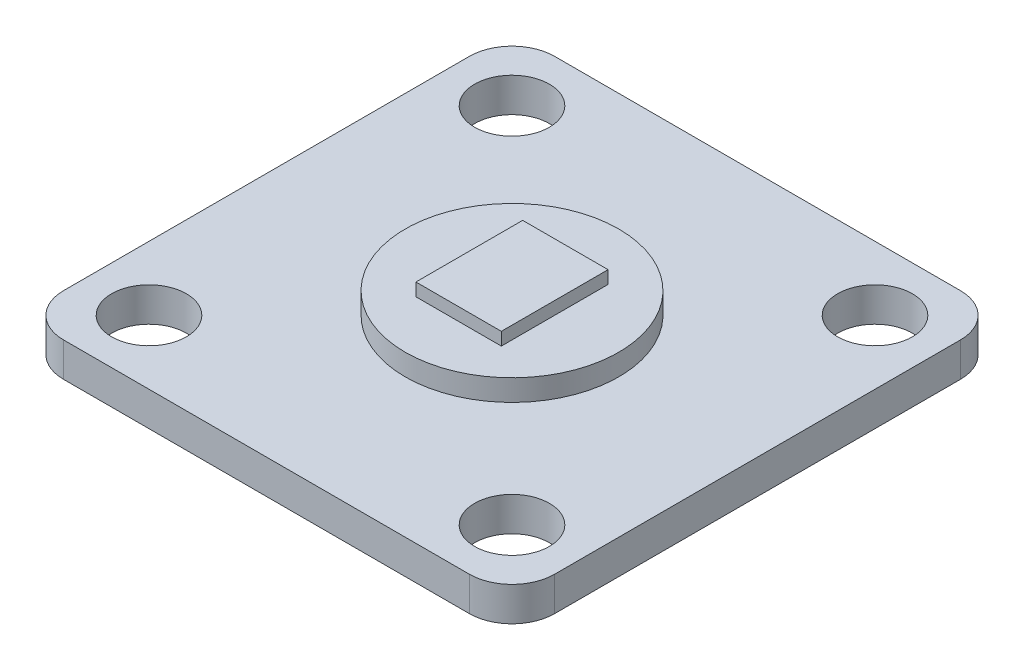
ISO-10303-21;
HEADER;
FILE_DESCRIPTION(('STEP AP214'),'2;1');
FILE_NAME('part.step','',(''),(''),'','','');
FILE_SCHEMA(('AUTOMOTIVE_DESIGN { 1 0 10303 214 1 1 1 1 }'));
ENDSEC;
DATA;
#1=APPLICATION_CONTEXT('core data for automotive mechanical design processes');
#2=APPLICATION_PROTOCOL_DEFINITION('international standard','automotive_design',2000,#1);
#3=PRODUCT_CONTEXT('',#1,'mechanical');
#4=PRODUCT('Part','Part','',(#3));
#5=PRODUCT_RELATED_PRODUCT_CATEGORY('part','',(#4));
#6=PRODUCT_DEFINITION_FORMATION('','',#4);
#7=PRODUCT_DEFINITION_CONTEXT('part definition',#1,'design');
#8=PRODUCT_DEFINITION('design','',#6,#7);
#9=PRODUCT_DEFINITION_SHAPE('','',#8);
#10=(LENGTH_UNIT() NAMED_UNIT(*) SI_UNIT(.MILLI.,.METRE.));
#11=(NAMED_UNIT(*) PLANE_ANGLE_UNIT() SI_UNIT($,.RADIAN.));
#12=(NAMED_UNIT(*) SI_UNIT($,.STERADIAN.) SOLID_ANGLE_UNIT());
#13=UNCERTAINTY_MEASURE_WITH_UNIT(LENGTH_MEASURE(1.E-05),#10,'distance_accuracy_value','');
#14=(GEOMETRIC_REPRESENTATION_CONTEXT(3) GLOBAL_UNCERTAINTY_ASSIGNED_CONTEXT((#13)) GLOBAL_UNIT_ASSIGNED_CONTEXT((#10,
#11,#12)) REPRESENTATION_CONTEXT('',''));
#15=CARTESIAN_POINT('',(0.,0.,0.));
#16=DIRECTION('',(0.,0.,1.));
#17=DIRECTION('',(1.,0.,0.));
#18=AXIS2_PLACEMENT_3D('',#15,#16,#17);
#19=CARTESIAN_POINT('',(-9.5,1.6,9.5));
#20=DIRECTION('',(0.,-1.,0.));
#21=DIRECTION('',(0.,0.,-1.));
#22=AXIS2_PLACEMENT_3D('',#19,#20,#21);
#23=PLANE('',#22);
#24=CARTESIAN_POINT('',(0.,1.6,0.));
#25=DIRECTION('',(0.,-1.,0.));
#26=DIRECTION('',(0.,0.,-1.));
#27=AXIS2_PLACEMENT_3D('',#24,#25,#26);
#28=CIRCLE('',#27,5.);
#29=CARTESIAN_POINT('',(0.,1.6,-5.));
#30=VERTEX_POINT('',#29);
#31=EDGE_CURVE('E11',#30,#30,#28,.F.);
#32=ORIENTED_EDGE('',*,*,#31,.F.);
#33=EDGE_LOOP('',(#32));
#34=FACE_BOUND('',#33,.T.);
#35=CARTESIAN_POINT('',(-8.5,1.6,-8.5));
#36=DIRECTION('',(0.,1.,0.));
#37=DIRECTION('',(0.,0.,1.));
#38=AXIS2_PLACEMENT_3D('',#35,#36,#37);
#39=CIRCLE('',#38,1.75);
#40=CARTESIAN_POINT('',(-8.5,1.6,-6.75));
#41=VERTEX_POINT('',#40);
#42=EDGE_CURVE('E239',#41,#41,#39,.T.);
#43=ORIENTED_EDGE('',*,*,#42,.F.);
#44=EDGE_LOOP('',(#43));
#45=FACE_BOUND('',#44,.T.);
#46=CARTESIAN_POINT('',(-8.5,1.6,8.5));
#47=DIRECTION('',(0.,1.,0.));
#48=DIRECTION('',(0.,0.,1.));
#49=AXIS2_PLACEMENT_3D('',#46,#47,#48);
#50=CIRCLE('',#49,1.75);
#51=CARTESIAN_POINT('',(-8.5,1.6,10.25));
#52=VERTEX_POINT('',#51);
#53=EDGE_CURVE('E247',#52,#52,#50,.T.);
#54=ORIENTED_EDGE('',*,*,#53,.F.);
#55=EDGE_LOOP('',(#54));
#56=FACE_BOUND('',#55,.T.);
#57=CARTESIAN_POINT('',(8.49999999999999,1.6,8.5));
#58=DIRECTION('',(0.,1.,0.));
#59=DIRECTION('',(0.,0.,1.));
#60=AXIS2_PLACEMENT_3D('',#57,#58,#59);
#61=CIRCLE('',#60,1.75);
#62=CARTESIAN_POINT('',(8.49999999999999,1.6,10.25));
#63=VERTEX_POINT('',#62);
#64=EDGE_CURVE('E255',#63,#63,#61,.T.);
#65=ORIENTED_EDGE('',*,*,#64,.F.);
#66=EDGE_LOOP('',(#65));
#67=FACE_BOUND('',#66,.T.);
#68=CARTESIAN_POINT('',(8.5,1.6,-8.5));
#69=DIRECTION('',(0.,1.,0.));
#70=DIRECTION('',(0.,0.,1.));
#71=AXIS2_PLACEMENT_3D('',#68,#69,#70);
#72=CIRCLE('',#71,1.75);
#73=CARTESIAN_POINT('',(8.5,1.6,-6.75));
#74=VERTEX_POINT('',#73);
#75=EDGE_CURVE('E159',#74,#74,#72,.T.);
#76=ORIENTED_EDGE('',*,*,#75,.F.);
#77=EDGE_LOOP('',(#76));
#78=FACE_BOUND('',#77,.T.);
#79=CARTESIAN_POINT('',(-9.5,1.6,9.5));
#80=DIRECTION('',(0.,1.,0.));
#81=DIRECTION('',(0.,0.,-1.));
#82=AXIS2_PLACEMENT_3D('',#79,#80,#81);
#83=CIRCLE('',#82,2.);
#84=CARTESIAN_POINT('',(-11.5,1.6,9.49999999999998));
#85=VERTEX_POINT('',#84);
#86=CARTESIAN_POINT('',(-9.49999999999999,1.6,11.5));
#87=VERTEX_POINT('',#86);
#88=EDGE_CURVE('E178',#85,#87,#83,.T.);
#89=ORIENTED_EDGE('',*,*,#88,.T.);
#90=DIRECTION('',(1.,0.,0.));
#91=VECTOR('',#90,1.);
#92=CARTESIAN_POINT('',(-9.49999999999999,1.6,11.5));
#93=LINE('',#92,#91);
#94=CARTESIAN_POINT('',(9.49999999999998,1.6,11.5));
#95=VERTEX_POINT('',#94);
#96=EDGE_CURVE('E108',#87,#95,#93,.T.);
#97=ORIENTED_EDGE('',*,*,#96,.T.);
#98=CARTESIAN_POINT('',(9.5,1.6,9.5));
#99=DIRECTION('',(0.,1.,0.));
#100=DIRECTION('',(0.,0.,1.));
#101=AXIS2_PLACEMENT_3D('',#98,#99,#100);
#102=CIRCLE('',#101,2.);
#103=CARTESIAN_POINT('',(11.5,1.6,9.49999999999998));
#104=VERTEX_POINT('',#103);
#105=EDGE_CURVE('E273',#95,#104,#102,.T.);
#106=ORIENTED_EDGE('',*,*,#105,.T.);
#107=DIRECTION('',(0.,0.,-1.));
#108=VECTOR('',#107,1.);
#109=CARTESIAN_POINT('',(11.5,1.6,9.49999999999998));
#110=LINE('',#109,#108);
#111=CARTESIAN_POINT('',(11.5,1.6,-9.49999999999999));
#112=VERTEX_POINT('',#111);
#113=EDGE_CURVE('E276',#104,#112,#110,.T.);
#114=ORIENTED_EDGE('',*,*,#113,.T.);
#115=CARTESIAN_POINT('',(9.5,1.6,-9.5));
#116=DIRECTION('',(0.,1.,0.));
#117=DIRECTION('',(0.,0.,-1.));
#118=AXIS2_PLACEMENT_3D('',#115,#116,#117);
#119=CIRCLE('',#118,2.);
#120=CARTESIAN_POINT('',(9.49999999999998,1.6,-11.5));
#121=VERTEX_POINT('',#120);
#122=EDGE_CURVE('E129',#112,#121,#119,.T.);
#123=ORIENTED_EDGE('',*,*,#122,.T.);
#124=DIRECTION('',(-1.,0.,0.));
#125=VECTOR('',#124,1.);
#126=CARTESIAN_POINT('',(-9.49999999999999,1.6,-11.5));
#127=LINE('',#126,#125);
#128=CARTESIAN_POINT('',(-9.49999999999999,1.6,-11.5));
#129=VERTEX_POINT('',#128);
#130=EDGE_CURVE('E123',#121,#129,#127,.T.);
#131=ORIENTED_EDGE('',*,*,#130,.T.);
#132=CARTESIAN_POINT('',(-9.5,1.6,-9.5));
#133=DIRECTION('',(0.,1.,0.));
#134=DIRECTION('',(0.,0.,-1.));
#135=AXIS2_PLACEMENT_3D('',#132,#133,#134);
#136=CIRCLE('',#135,2.);
#137=CARTESIAN_POINT('',(-11.5,1.6,-9.49999999999999));
#138=VERTEX_POINT('',#137);
#139=EDGE_CURVE('E126',#129,#138,#136,.T.);
#140=ORIENTED_EDGE('',*,*,#139,.T.);
#141=DIRECTION('',(0.,0.,1.));
#142=VECTOR('',#141,1.);
#143=CARTESIAN_POINT('',(-11.5,1.6,9.49999999999998));
#144=LINE('',#143,#142);
#145=EDGE_CURVE('E66',#138,#85,#144,.T.);
#146=ORIENTED_EDGE('',*,*,#145,.T.);
#147=EDGE_LOOP('',(#89,#97,#106,#114,#123,#131,#140,#146));
#148=FACE_BOUND('',#147,.T.);
#149=ADVANCED_FACE('F41',(#34,#45,#56,#67,#78,#148),#23,.F.);
#150=CARTESIAN_POINT('',(-9.5,0.,9.5));
#151=DIRECTION('',(0.,-1.,0.));
#152=DIRECTION('',(0.,0.,-1.));
#153=AXIS2_PLACEMENT_3D('',#150,#151,#152);
#154=PLANE('',#153);
#155=CARTESIAN_POINT('',(-8.5,0.,8.5));
#156=DIRECTION('',(0.,1.,0.));
#157=DIRECTION('',(0.,0.,1.));
#158=AXIS2_PLACEMENT_3D('',#155,#156,#157);
#159=CIRCLE('',#158,1.75);
#160=CARTESIAN_POINT('',(-8.5,0.,10.25));
#161=VERTEX_POINT('',#160);
#162=EDGE_CURVE('E243',#161,#161,#159,.T.);
#163=ORIENTED_EDGE('',*,*,#162,.T.);
#164=EDGE_LOOP('',(#163));
#165=FACE_BOUND('',#164,.T.);
#166=CARTESIAN_POINT('',(8.5,0.,-8.5));
#167=DIRECTION('',(0.,1.,0.));
#168=DIRECTION('',(0.,0.,1.));
#169=AXIS2_PLACEMENT_3D('',#166,#167,#168);
#170=CIRCLE('',#169,1.75);
#171=CARTESIAN_POINT('',(8.5,0.,-6.75));
#172=VERTEX_POINT('',#171);
#173=EDGE_CURVE('E259',#172,#172,#170,.T.);
#174=ORIENTED_EDGE('',*,*,#173,.T.);
#175=EDGE_LOOP('',(#174));
#176=FACE_BOUND('',#175,.T.);
#177=CARTESIAN_POINT('',(-9.5,0.,9.5));
#178=DIRECTION('',(0.,1.,0.));
#179=DIRECTION('',(0.,0.,-1.));
#180=AXIS2_PLACEMENT_3D('',#177,#178,#179);
#181=CIRCLE('',#180,2.);
#182=CARTESIAN_POINT('',(-11.5,0.,9.49999999999998));
#183=VERTEX_POINT('',#182);
#184=CARTESIAN_POINT('',(-9.49999999999999,0.,11.5));
#185=VERTEX_POINT('',#184);
#186=EDGE_CURVE('E154',#183,#185,#181,.T.);
#187=ORIENTED_EDGE('',*,*,#186,.F.);
#188=DIRECTION('',(0.,0.,1.));
#189=VECTOR('',#188,1.);
#190=CARTESIAN_POINT('',(-11.5,0.,9.49999999999998));
#191=LINE('',#190,#189);
#192=CARTESIAN_POINT('',(-11.5,0.,-9.49999999999999));
#193=VERTEX_POINT('',#192);
#194=EDGE_CURVE('E99',#193,#183,#191,.T.);
#195=ORIENTED_EDGE('',*,*,#194,.F.);
#196=CARTESIAN_POINT('',(-9.5,0.,-9.5));
#197=DIRECTION('',(0.,1.,0.));
#198=DIRECTION('',(0.,0.,-1.));
#199=AXIS2_PLACEMENT_3D('',#196,#197,#198);
#200=CIRCLE('',#199,2.);
#201=CARTESIAN_POINT('',(-9.49999999999999,0.,-11.5));
#202=VERTEX_POINT('',#201);
#203=EDGE_CURVE('E173',#202,#193,#200,.T.);
#204=ORIENTED_EDGE('',*,*,#203,.F.);
#205=DIRECTION('',(-1.,0.,0.));
#206=VECTOR('',#205,1.);
#207=CARTESIAN_POINT('',(-9.49999999999999,0.,-11.5));
#208=LINE('',#207,#206);
#209=CARTESIAN_POINT('',(9.49999999999998,0.,-11.5));
#210=VERTEX_POINT('',#209);
#211=EDGE_CURVE('E139',#210,#202,#208,.T.);
#212=ORIENTED_EDGE('',*,*,#211,.F.);
#213=CARTESIAN_POINT('',(9.5,0.,-9.5));
#214=DIRECTION('',(0.,1.,0.));
#215=DIRECTION('',(0.,0.,-1.));
#216=AXIS2_PLACEMENT_3D('',#213,#214,#215);
#217=CIRCLE('',#216,2.);
#218=CARTESIAN_POINT('',(11.5,0.,-9.49999999999999));
#219=VERTEX_POINT('',#218);
#220=EDGE_CURVE('E168',#219,#210,#217,.T.);
#221=ORIENTED_EDGE('',*,*,#220,.F.);
#222=DIRECTION('',(0.,0.,-1.));
#223=VECTOR('',#222,1.);
#224=CARTESIAN_POINT('',(11.5,0.,9.49999999999998));
#225=LINE('',#224,#223);
#226=CARTESIAN_POINT('',(11.5,0.,9.49999999999998));
#227=VERTEX_POINT('',#226);
#228=EDGE_CURVE('E165',#227,#219,#225,.T.);
#229=ORIENTED_EDGE('',*,*,#228,.F.);
#230=CARTESIAN_POINT('',(9.5,0.,9.5));
#231=DIRECTION('',(0.,1.,0.));
#232=DIRECTION('',(0.,0.,1.));
#233=AXIS2_PLACEMENT_3D('',#230,#231,#232);
#234=CIRCLE('',#233,2.);
#235=CARTESIAN_POINT('',(9.49999999999998,0.,11.5));
#236=VERTEX_POINT('',#235);
#237=EDGE_CURVE('E162',#236,#227,#234,.T.);
#238=ORIENTED_EDGE('',*,*,#237,.F.);
#239=DIRECTION('',(1.,0.,0.));
#240=VECTOR('',#239,1.);
#241=CARTESIAN_POINT('',(-9.49999999999999,0.,11.5));
#242=LINE('',#241,#240);
#243=EDGE_CURVE('E158',#185,#236,#242,.T.);
#244=ORIENTED_EDGE('',*,*,#243,.F.);
#245=EDGE_LOOP('',(#187,#195,#204,#212,#221,#229,#238,#244));
#246=FACE_BOUND('',#245,.T.);
#247=CARTESIAN_POINT('',(8.49999999999999,0.,8.5));
#248=DIRECTION('',(0.,1.,0.));
#249=DIRECTION('',(0.,0.,1.));
#250=AXIS2_PLACEMENT_3D('',#247,#248,#249);
#251=CIRCLE('',#250,1.75);
#252=CARTESIAN_POINT('',(8.49999999999999,0.,10.25));
#253=VERTEX_POINT('',#252);
#254=EDGE_CURVE('E251',#253,#253,#251,.T.);
#255=ORIENTED_EDGE('',*,*,#254,.T.);
#256=EDGE_LOOP('',(#255));
#257=FACE_BOUND('',#256,.T.);
#258=CARTESIAN_POINT('',(-8.5,0.,-8.5));
#259=DIRECTION('',(0.,1.,0.));
#260=DIRECTION('',(0.,0.,1.));
#261=AXIS2_PLACEMENT_3D('',#258,#259,#260);
#262=CIRCLE('',#261,1.75);
#263=CARTESIAN_POINT('',(-8.5,0.,-6.75));
#264=VERTEX_POINT('',#263);
#265=EDGE_CURVE('E238',#264,#264,#262,.T.);
#266=ORIENTED_EDGE('',*,*,#265,.T.);
#267=EDGE_LOOP('',(#266));
#268=FACE_BOUND('',#267,.T.);
#269=ADVANCED_FACE('F291',(#165,#176,#246,#257,#268),#154,.T.);
#270=CARTESIAN_POINT('',(-9.5,1.6,9.5));
#271=DIRECTION('',(0.,-1.,0.));
#272=DIRECTION('',(0.,0.,-1.));
#273=AXIS2_PLACEMENT_3D('',#270,#271,#272);
#274=CYLINDRICAL_SURFACE('',#273,2.);
#275=ORIENTED_EDGE('',*,*,#186,.T.);
#276=DIRECTION('',(0.,-1.,0.));
#277=VECTOR('',#276,1.);
#278=CARTESIAN_POINT('',(-9.49999999999999,1.6,11.5));
#279=LINE('',#278,#277);
#280=EDGE_CURVE('E197',#87,#185,#279,.T.);
#281=ORIENTED_EDGE('',*,*,#280,.F.);
#282=ORIENTED_EDGE('',*,*,#88,.F.);
#283=DIRECTION('',(0.,-1.,0.));
#284=VECTOR('',#283,1.);
#285=CARTESIAN_POINT('',(-11.5,1.6,9.49999999999998));
#286=LINE('',#285,#284);
#287=EDGE_CURVE('E150',#85,#183,#286,.T.);
#288=ORIENTED_EDGE('',*,*,#287,.T.);
#289=EDGE_LOOP('',(#275,#281,#282,#288));
#290=FACE_BOUND('',#289,.T.);
#291=ADVANCED_FACE('F43',(#290),#274,.T.);
#292=CARTESIAN_POINT('',(-9.49999999999999,1.6,11.5));
#293=DIRECTION('',(0.,0.,-1.));
#294=DIRECTION('',(-1.,0.,0.));
#295=AXIS2_PLACEMENT_3D('',#292,#293,#294);
#296=PLANE('',#295);
#297=ORIENTED_EDGE('',*,*,#243,.T.);
#298=DIRECTION('',(0.,-1.,0.));
#299=VECTOR('',#298,1.);
#300=CARTESIAN_POINT('',(9.49999999999998,1.6,11.5));
#301=LINE('',#300,#299);
#302=EDGE_CURVE('E193',#95,#236,#301,.T.);
#303=ORIENTED_EDGE('',*,*,#302,.F.);
#304=ORIENTED_EDGE('',*,*,#96,.F.);
#305=ORIENTED_EDGE('',*,*,#280,.T.);
#306=EDGE_LOOP('',(#297,#303,#304,#305));
#307=FACE_BOUND('',#306,.T.);
#308=ADVANCED_FACE('F297',(#307),#296,.F.);
#309=CARTESIAN_POINT('',(9.5,1.6,9.5));
#310=DIRECTION('',(0.,-1.,0.));
#311=DIRECTION('',(0.,0.,-1.));
#312=AXIS2_PLACEMENT_3D('',#309,#310,#311);
#313=CYLINDRICAL_SURFACE('',#312,2.);
#314=ORIENTED_EDGE('',*,*,#237,.T.);
#315=DIRECTION('',(0.,-1.,0.));
#316=VECTOR('',#315,1.);
#317=CARTESIAN_POINT('',(11.5,1.6,9.49999999999998));
#318=LINE('',#317,#316);
#319=EDGE_CURVE('E189',#104,#227,#318,.T.);
#320=ORIENTED_EDGE('',*,*,#319,.F.);
#321=ORIENTED_EDGE('',*,*,#105,.F.);
#322=ORIENTED_EDGE('',*,*,#302,.T.);
#323=EDGE_LOOP('',(#314,#320,#321,#322));
#324=FACE_BOUND('',#323,.T.);
#325=ADVANCED_FACE('F300',(#324),#313,.T.);
#326=CARTESIAN_POINT('',(11.5,1.6,9.49999999999998));
#327=DIRECTION('',(-1.,0.,0.));
#328=DIRECTION('',(0.,0.,1.));
#329=AXIS2_PLACEMENT_3D('',#326,#327,#328);
#330=PLANE('',#329);
#331=ORIENTED_EDGE('',*,*,#228,.T.);
#332=DIRECTION('',(0.,-1.,0.));
#333=VECTOR('',#332,1.);
#334=CARTESIAN_POINT('',(11.5,1.6,-9.49999999999999));
#335=LINE('',#334,#333);
#336=EDGE_CURVE('E185',#112,#219,#335,.T.);
#337=ORIENTED_EDGE('',*,*,#336,.F.);
#338=ORIENTED_EDGE('',*,*,#113,.F.);
#339=ORIENTED_EDGE('',*,*,#319,.T.);
#340=EDGE_LOOP('',(#331,#337,#338,#339));
#341=FACE_BOUND('',#340,.T.);
#342=ADVANCED_FACE('F284',(#341),#330,.F.);
#343=CARTESIAN_POINT('',(9.5,1.6,-9.5));
#344=DIRECTION('',(0.,-1.,0.));
#345=DIRECTION('',(0.,0.,-1.));
#346=AXIS2_PLACEMENT_3D('',#343,#344,#345);
#347=CYLINDRICAL_SURFACE('',#346,2.);
#348=ORIENTED_EDGE('',*,*,#220,.T.);
#349=DIRECTION('',(0.,-1.,0.));
#350=VECTOR('',#349,1.);
#351=CARTESIAN_POINT('',(9.49999999999998,1.6,-11.5));
#352=LINE('',#351,#350);
#353=EDGE_CURVE('E143',#121,#210,#352,.T.);
#354=ORIENTED_EDGE('',*,*,#353,.F.);
#355=ORIENTED_EDGE('',*,*,#122,.F.);
#356=ORIENTED_EDGE('',*,*,#336,.T.);
#357=EDGE_LOOP('',(#348,#354,#355,#356));
#358=FACE_BOUND('',#357,.T.);
#359=ADVANCED_FACE('F288',(#358),#347,.T.);
#360=CARTESIAN_POINT('',(-9.49999999999999,1.6,-11.5));
#361=DIRECTION('',(0.,0.,1.));
#362=DIRECTION('',(1.,0.,0.));
#363=AXIS2_PLACEMENT_3D('',#360,#361,#362);
#364=PLANE('',#363);
#365=ORIENTED_EDGE('',*,*,#211,.T.);
#366=DIRECTION('',(0.,-1.,0.));
#367=VECTOR('',#366,1.);
#368=CARTESIAN_POINT('',(-9.49999999999999,1.6,-11.5));
#369=LINE('',#368,#367);
#370=EDGE_CURVE('E136',#129,#202,#369,.T.);
#371=ORIENTED_EDGE('',*,*,#370,.F.);
#372=ORIENTED_EDGE('',*,*,#130,.F.);
#373=ORIENTED_EDGE('',*,*,#353,.T.);
#374=EDGE_LOOP('',(#365,#371,#372,#373));
#375=FACE_BOUND('',#374,.T.);
#376=ADVANCED_FACE('F137',(#375),#364,.F.);
#377=CARTESIAN_POINT('',(-9.5,1.6,-9.5));
#378=DIRECTION('',(0.,-1.,0.));
#379=DIRECTION('',(0.,0.,-1.));
#380=AXIS2_PLACEMENT_3D('',#377,#378,#379);
#381=CYLINDRICAL_SURFACE('',#380,2.);
#382=ORIENTED_EDGE('',*,*,#203,.T.);
#383=DIRECTION('',(0.,-1.,0.));
#384=VECTOR('',#383,1.);
#385=CARTESIAN_POINT('',(-11.5,1.6,-9.49999999999999));
#386=LINE('',#385,#384);
#387=EDGE_CURVE('E144',#138,#193,#386,.T.);
#388=ORIENTED_EDGE('',*,*,#387,.F.);
#389=ORIENTED_EDGE('',*,*,#139,.F.);
#390=ORIENTED_EDGE('',*,*,#370,.T.);
#391=EDGE_LOOP('',(#382,#388,#389,#390));
#392=FACE_BOUND('',#391,.T.);
#393=ADVANCED_FACE('F146',(#392),#381,.T.);
#394=CARTESIAN_POINT('',(-11.5,1.6,9.49999999999998));
#395=DIRECTION('',(1.,0.,0.));
#396=DIRECTION('',(0.,0.,-1.));
#397=AXIS2_PLACEMENT_3D('',#394,#395,#396);
#398=PLANE('',#397);
#399=ORIENTED_EDGE('',*,*,#194,.T.);
#400=ORIENTED_EDGE('',*,*,#287,.F.);
#401=ORIENTED_EDGE('',*,*,#145,.F.);
#402=ORIENTED_EDGE('',*,*,#387,.T.);
#403=EDGE_LOOP('',(#399,#400,#401,#402));
#404=FACE_BOUND('',#403,.T.);
#405=ADVANCED_FACE('F293',(#404),#398,.F.);
#406=CARTESIAN_POINT('',(8.5,1.6,-8.5));
#407=DIRECTION('',(0.,-1.,0.));
#408=DIRECTION('',(0.,0.,-1.));
#409=AXIS2_PLACEMENT_3D('',#406,#407,#408);
#410=CYLINDRICAL_SURFACE('',#409,1.75);
#411=ORIENTED_EDGE('',*,*,#75,.T.);
#412=EDGE_LOOP('',(#411));
#413=FACE_BOUND('',#412,.T.);
#414=ORIENTED_EDGE('',*,*,#173,.F.);
#415=EDGE_LOOP('',(#414));
#416=FACE_BOUND('',#415,.T.);
#417=ADVANCED_FACE('F321',(#413,#416),#410,.F.);
#418=CARTESIAN_POINT('',(8.49999999999999,1.6,8.5));
#419=DIRECTION('',(0.,-1.,0.));
#420=DIRECTION('',(0.,0.,-1.));
#421=AXIS2_PLACEMENT_3D('',#418,#419,#420);
#422=CYLINDRICAL_SURFACE('',#421,1.75);
#423=ORIENTED_EDGE('',*,*,#64,.T.);
#424=EDGE_LOOP('',(#423));
#425=FACE_BOUND('',#424,.T.);
#426=ORIENTED_EDGE('',*,*,#254,.F.);
#427=EDGE_LOOP('',(#426));
#428=FACE_BOUND('',#427,.T.);
#429=ADVANCED_FACE('F353',(#425,#428),#422,.F.);
#430=CARTESIAN_POINT('',(-8.5,1.6,8.5));
#431=DIRECTION('',(0.,-1.,0.));
#432=DIRECTION('',(0.,0.,-1.));
#433=AXIS2_PLACEMENT_3D('',#430,#431,#432);
#434=CYLINDRICAL_SURFACE('',#433,1.75);
#435=ORIENTED_EDGE('',*,*,#53,.T.);
#436=EDGE_LOOP('',(#435));
#437=FACE_BOUND('',#436,.T.);
#438=ORIENTED_EDGE('',*,*,#162,.F.);
#439=EDGE_LOOP('',(#438));
#440=FACE_BOUND('',#439,.T.);
#441=ADVANCED_FACE('F360',(#437,#440),#434,.F.);
#442=CARTESIAN_POINT('',(-8.5,1.6,-8.5));
#443=DIRECTION('',(0.,-1.,0.));
#444=DIRECTION('',(0.,0.,-1.));
#445=AXIS2_PLACEMENT_3D('',#442,#443,#444);
#446=CYLINDRICAL_SURFACE('',#445,1.75);
#447=ORIENTED_EDGE('',*,*,#42,.T.);
#448=EDGE_LOOP('',(#447));
#449=FACE_BOUND('',#448,.T.);
#450=ORIENTED_EDGE('',*,*,#265,.F.);
#451=EDGE_LOOP('',(#450));
#452=FACE_BOUND('',#451,.T.);
#453=ADVANCED_FACE('F367',(#449,#452),#446,.F.);
#454=CARTESIAN_POINT('',(0.,2.6,0.));
#455=DIRECTION('',(0.,1.,0.));
#456=DIRECTION('',(0.,0.,1.));
#457=AXIS2_PLACEMENT_3D('',#454,#455,#456);
#458=PLANE('',#457);
#459=CARTESIAN_POINT('',(0.,2.6,0.));
#460=DIRECTION('',(0.,1.,0.));
#461=DIRECTION('',(0.,0.,1.));
#462=AXIS2_PLACEMENT_3D('',#459,#460,#461);
#463=CIRCLE('',#462,5.);
#464=CARTESIAN_POINT('',(0.,2.6,5.));
#465=VERTEX_POINT('',#464);
#466=EDGE_CURVE('E452',#465,#465,#463,.T.);
#467=ORIENTED_EDGE('',*,*,#466,.T.);
#468=EDGE_LOOP('',(#467));
#469=FACE_BOUND('',#468,.T.);
#470=DIRECTION('',(0.,0.,-1.));
#471=VECTOR('',#470,1.);
#472=CARTESIAN_POINT('',(2.,2.6,2.5));
#473=LINE('',#472,#471);
#474=CARTESIAN_POINT('',(2.,2.6,2.5));
#475=VERTEX_POINT('',#474);
#476=CARTESIAN_POINT('',(2.,2.6,-2.5));
#477=VERTEX_POINT('',#476);
#478=EDGE_CURVE('E57',#475,#477,#473,.T.);
#479=ORIENTED_EDGE('',*,*,#478,.F.);
#480=DIRECTION('',(1.,0.,0.));
#481=VECTOR('',#480,1.);
#482=CARTESIAN_POINT('',(-2.,2.6,2.5));
#483=LINE('',#482,#481);
#484=CARTESIAN_POINT('',(-2.,2.6,2.5));
#485=VERTEX_POINT('',#484);
#486=EDGE_CURVE('E50',#485,#475,#483,.T.);
#487=ORIENTED_EDGE('',*,*,#486,.F.);
#488=DIRECTION('',(0.,0.,1.));
#489=VECTOR('',#488,1.);
#490=CARTESIAN_POINT('',(-2.,2.6,2.5));
#491=LINE('',#490,#489);
#492=CARTESIAN_POINT('',(-2.,2.6,-2.5));
#493=VERTEX_POINT('',#492);
#494=EDGE_CURVE('E454',#493,#485,#491,.T.);
#495=ORIENTED_EDGE('',*,*,#494,.F.);
#496=DIRECTION('',(-1.,0.,0.));
#497=VECTOR('',#496,1.);
#498=CARTESIAN_POINT('',(-2.,2.6,-2.5));
#499=LINE('',#498,#497);
#500=EDGE_CURVE('E457',#477,#493,#499,.T.);
#501=ORIENTED_EDGE('',*,*,#500,.F.);
#502=EDGE_LOOP('',(#479,#487,#495,#501));
#503=FACE_BOUND('',#502,.T.);
#504=ADVANCED_FACE('F375',(#469,#503),#458,.T.);
#505=CARTESIAN_POINT('',(0.,2.6,0.));
#506=DIRECTION('',(0.,-1.,0.));
#507=DIRECTION('',(0.,0.,-1.));
#508=AXIS2_PLACEMENT_3D('',#505,#506,#507);
#509=CYLINDRICAL_SURFACE('',#508,5.);
#510=ORIENTED_EDGE('',*,*,#466,.F.);
#511=EDGE_LOOP('',(#510));
#512=FACE_BOUND('',#511,.T.);
#513=ORIENTED_EDGE('',*,*,#31,.T.);
#514=EDGE_LOOP('',(#513));
#515=FACE_BOUND('',#514,.T.);
#516=ADVANCED_FACE('F427',(#512,#515),#509,.T.);
#517=CARTESIAN_POINT('',(0.,3.2,0.));
#518=DIRECTION('',(0.,-1.,0.));
#519=DIRECTION('',(0.,0.,-1.));
#520=AXIS2_PLACEMENT_3D('',#517,#518,#519);
#521=PLANE('',#520);
#522=DIRECTION('',(0.,0.,-1.));
#523=VECTOR('',#522,1.);
#524=CARTESIAN_POINT('',(2.,3.2,2.5));
#525=LINE('',#524,#523);
#526=CARTESIAN_POINT('',(2.,3.2,2.5));
#527=VERTEX_POINT('',#526);
#528=CARTESIAN_POINT('',(2.,3.2,-2.5));
#529=VERTEX_POINT('',#528);
#530=EDGE_CURVE('E219',#527,#529,#525,.T.);
#531=ORIENTED_EDGE('',*,*,#530,.T.);
#532=DIRECTION('',(-1.,0.,0.));
#533=VECTOR('',#532,1.);
#534=CARTESIAN_POINT('',(-2.,3.2,-2.5));
#535=LINE('',#534,#533);
#536=CARTESIAN_POINT('',(-2.,3.2,-2.5));
#537=VERTEX_POINT('',#536);
#538=EDGE_CURVE('E467',#529,#537,#535,.T.);
#539=ORIENTED_EDGE('',*,*,#538,.T.);
#540=DIRECTION('',(0.,0.,1.));
#541=VECTOR('',#540,1.);
#542=CARTESIAN_POINT('',(-2.,3.2,2.5));
#543=LINE('',#542,#541);
#544=CARTESIAN_POINT('',(-2.,3.2,2.5));
#545=VERTEX_POINT('',#544);
#546=EDGE_CURVE('E228',#537,#545,#543,.T.);
#547=ORIENTED_EDGE('',*,*,#546,.T.);
#548=DIRECTION('',(1.,0.,0.));
#549=VECTOR('',#548,1.);
#550=CARTESIAN_POINT('',(-2.,3.2,2.5));
#551=LINE('',#550,#549);
#552=EDGE_CURVE('E221',#545,#527,#551,.T.);
#553=ORIENTED_EDGE('',*,*,#552,.T.);
#554=EDGE_LOOP('',(#531,#539,#547,#553));
#555=FACE_BOUND('',#554,.T.);
#556=ADVANCED_FACE('F417',(#555),#521,.F.);
#557=CARTESIAN_POINT('',(-2.,3.2,2.5));
#558=DIRECTION('',(0.,0.,-1.));
#559=DIRECTION('',(-1.,0.,0.));
#560=AXIS2_PLACEMENT_3D('',#557,#558,#559);
#561=PLANE('',#560);
#562=DIRECTION('',(0.,-1.,0.));
#563=VECTOR('',#562,1.);
#564=CARTESIAN_POINT('',(-2.,3.2,2.5));
#565=LINE('',#564,#563);
#566=EDGE_CURVE('E210',#545,#485,#565,.T.);
#567=ORIENTED_EDGE('',*,*,#566,.T.);
#568=ORIENTED_EDGE('',*,*,#486,.T.);
#569=DIRECTION('',(0.,-1.,0.));
#570=VECTOR('',#569,1.);
#571=CARTESIAN_POINT('',(2.,3.2,2.5));
#572=LINE('',#571,#570);
#573=EDGE_CURVE('E206',#527,#475,#572,.T.);
#574=ORIENTED_EDGE('',*,*,#573,.F.);
#575=ORIENTED_EDGE('',*,*,#552,.F.);
#576=EDGE_LOOP('',(#567,#568,#574,#575));
#577=FACE_BOUND('',#576,.T.);
#578=ADVANCED_FACE('F204',(#577),#561,.F.);
#579=CARTESIAN_POINT('',(-2.,3.2,2.5));
#580=DIRECTION('',(1.,0.,0.));
#581=DIRECTION('',(0.,0.,-1.));
#582=AXIS2_PLACEMENT_3D('',#579,#580,#581);
#583=PLANE('',#582);
#584=DIRECTION('',(0.,-1.,0.));
#585=VECTOR('',#584,1.);
#586=CARTESIAN_POINT('',(-2.,3.2,-2.5));
#587=LINE('',#586,#585);
#588=EDGE_CURVE('E225',#537,#493,#587,.T.);
#589=ORIENTED_EDGE('',*,*,#588,.T.);
#590=ORIENTED_EDGE('',*,*,#494,.T.);
#591=ORIENTED_EDGE('',*,*,#566,.F.);
#592=ORIENTED_EDGE('',*,*,#546,.F.);
#593=EDGE_LOOP('',(#589,#590,#591,#592));
#594=FACE_BOUND('',#593,.T.);
#595=ADVANCED_FACE('F396',(#594),#583,.F.);
#596=CARTESIAN_POINT('',(-2.,3.2,-2.5));
#597=DIRECTION('',(0.,0.,1.));
#598=DIRECTION('',(1.,0.,0.));
#599=AXIS2_PLACEMENT_3D('',#596,#597,#598);
#600=PLANE('',#599);
#601=DIRECTION('',(0.,-1.,0.));
#602=VECTOR('',#601,1.);
#603=CARTESIAN_POINT('',(2.,3.2,-2.5));
#604=LINE('',#603,#602);
#605=EDGE_CURVE('E235',#529,#477,#604,.T.);
#606=ORIENTED_EDGE('',*,*,#605,.T.);
#607=ORIENTED_EDGE('',*,*,#500,.T.);
#608=ORIENTED_EDGE('',*,*,#588,.F.);
#609=ORIENTED_EDGE('',*,*,#538,.F.);
#610=EDGE_LOOP('',(#606,#607,#608,#609));
#611=FACE_BOUND('',#610,.T.);
#612=ADVANCED_FACE('F385',(#611),#600,.F.);
#613=CARTESIAN_POINT('',(2.,3.2,2.5));
#614=DIRECTION('',(-1.,0.,0.));
#615=DIRECTION('',(0.,0.,1.));
#616=AXIS2_PLACEMENT_3D('',#613,#614,#615);
#617=PLANE('',#616);
#618=ORIENTED_EDGE('',*,*,#573,.T.);
#619=ORIENTED_EDGE('',*,*,#478,.T.);
#620=ORIENTED_EDGE('',*,*,#605,.F.);
#621=ORIENTED_EDGE('',*,*,#530,.F.);
#622=EDGE_LOOP('',(#618,#619,#620,#621));
#623=FACE_BOUND('',#622,.T.);
#624=ADVANCED_FACE('F214',(#623),#617,.F.);
#625=CLOSED_SHELL('',(#149,#269,#291,#308,#325,#342,#359,#376,#393,#405,#417,#429,#441,#453,
#504,#516,#556,#578,#595,#612,#624));
#626=MANIFOLD_SOLID_BREP('B2',#625);
#627=ADVANCED_BREP_SHAPE_REPRESENTATION('',(#18,#626),#14);
#628=SHAPE_DEFINITION_REPRESENTATION(#9,#627);
ENDSEC;
END-ISO-10303-21;
